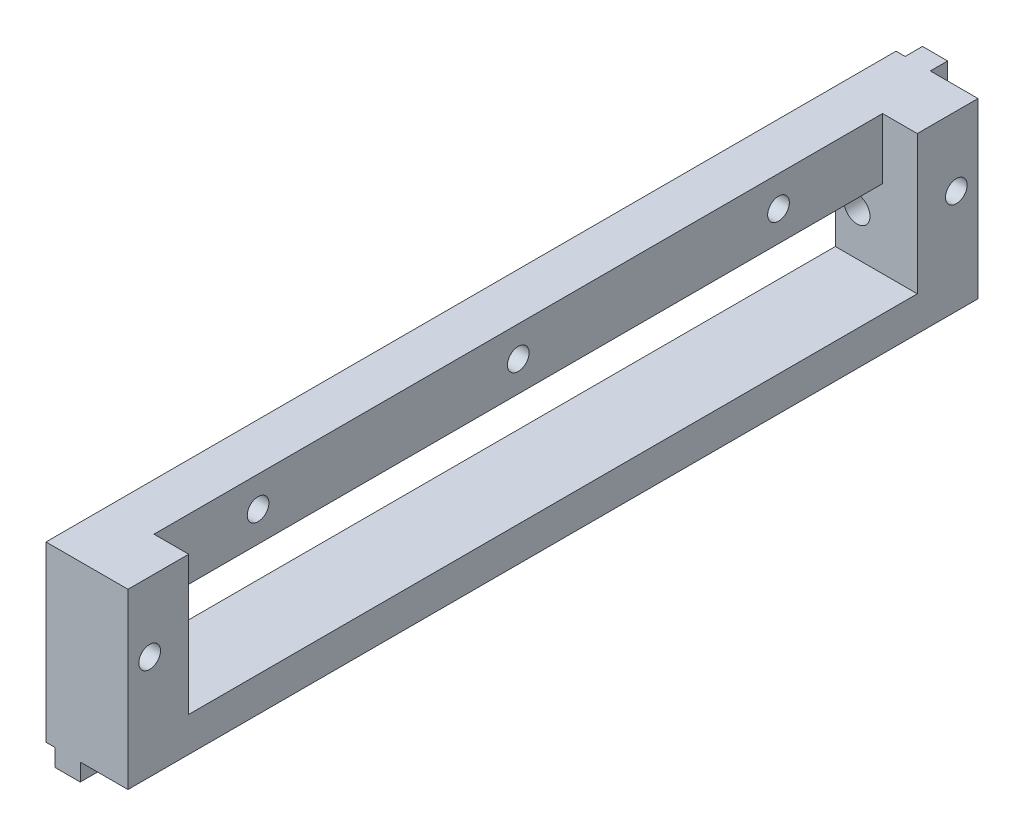
ISO-10303-21;
HEADER;
FILE_DESCRIPTION(('STEP AP214'),'2;1');
FILE_NAME('part.step','',(''),(''),'','','');
FILE_SCHEMA(('AUTOMOTIVE_DESIGN { 1 0 10303 214 1 1 1 1 }'));
ENDSEC;
DATA;
#1=APPLICATION_CONTEXT('core data for automotive mechanical design processes');
#2=APPLICATION_PROTOCOL_DEFINITION('international standard','automotive_design',2000,#1);
#3=PRODUCT_CONTEXT('',#1,'mechanical');
#4=PRODUCT('Part','Part','',(#3));
#5=PRODUCT_RELATED_PRODUCT_CATEGORY('part','',(#4));
#6=PRODUCT_DEFINITION_FORMATION('','',#4);
#7=PRODUCT_DEFINITION_CONTEXT('part definition',#1,'design');
#8=PRODUCT_DEFINITION('design','',#6,#7);
#9=PRODUCT_DEFINITION_SHAPE('','',#8);
#10=(LENGTH_UNIT() NAMED_UNIT(*) SI_UNIT(.MILLI.,.METRE.));
#11=(NAMED_UNIT(*) PLANE_ANGLE_UNIT() SI_UNIT($,.RADIAN.));
#12=(NAMED_UNIT(*) SI_UNIT($,.STERADIAN.) SOLID_ANGLE_UNIT());
#13=UNCERTAINTY_MEASURE_WITH_UNIT(LENGTH_MEASURE(1.E-05),#10,'distance_accuracy_value','');
#14=(GEOMETRIC_REPRESENTATION_CONTEXT(3) GLOBAL_UNCERTAINTY_ASSIGNED_CONTEXT((#13)) GLOBAL_UNIT_ASSIGNED_CONTEXT((#10,
#11,#12)) REPRESENTATION_CONTEXT('',''));
#15=CARTESIAN_POINT('',(0.,0.,0.));
#16=DIRECTION('',(0.,0.,1.));
#17=DIRECTION('',(1.,0.,0.));
#18=AXIS2_PLACEMENT_3D('',#15,#16,#17);
#19=CARTESIAN_POINT('',(1.05,0.,-51.));
#20=DIRECTION('',(1.,0.,0.));
#21=DIRECTION('',(0.,0.,-1.));
#22=AXIS2_PLACEMENT_3D('',#19,#20,#21);
#23=PLANE('',#22);
#24=DIRECTION('',(0.,1.,0.));
#25=VECTOR('',#24,1.);
#26=CARTESIAN_POINT('',(1.05,0.,-49.));
#27=LINE('',#26,#25);
#28=CARTESIAN_POINT('',(1.05,0.,-49.));
#29=VERTEX_POINT('',#28);
#30=CARTESIAN_POINT('',(1.05,8.61594271260657,-49.));
#31=VERTEX_POINT('',#30);
#32=EDGE_CURVE('E238',#29,#31,#27,.T.);
#33=ORIENTED_EDGE('',*,*,#32,.T.);
#34=DIRECTION('',(0.,0.,-1.));
#35=VECTOR('',#34,1.);
#36=CARTESIAN_POINT('',(1.05,8.61594271260657,-31.));
#37=LINE('',#36,#35);
#38=CARTESIAN_POINT('',(1.05,8.61594271260657,-51.));
#39=VERTEX_POINT('',#38);
#40=EDGE_CURVE('E221',#31,#39,#37,.T.);
#41=ORIENTED_EDGE('',*,*,#40,.T.);
#42=DIRECTION('',(0.,1.,0.));
#43=VECTOR('',#42,1.);
#44=CARTESIAN_POINT('',(1.05,0.,-51.));
#45=LINE('',#44,#43);
#46=CARTESIAN_POINT('',(1.05,0.,-51.));
#47=VERTEX_POINT('',#46);
#48=EDGE_CURVE('E225',#47,#39,#45,.T.);
#49=ORIENTED_EDGE('',*,*,#48,.F.);
#50=DIRECTION('',(0.,0.,1.));
#51=VECTOR('',#50,1.);
#52=CARTESIAN_POINT('',(1.05,0.,-51.));
#53=LINE('',#52,#51);
#54=EDGE_CURVE('E237',#47,#29,#53,.T.);
#55=ORIENTED_EDGE('',*,*,#54,.T.);
#56=EDGE_LOOP('',(#33,#41,#49,#55));
#57=FACE_BOUND('',#56,.T.);
#58=ADVANCED_FACE('F33',(#57),#23,.F.);
#59=CARTESIAN_POINT('',(3.95,0.,-51.));
#60=DIRECTION('',(-1.,0.,0.));
#61=DIRECTION('',(0.,0.,1.));
#62=AXIS2_PLACEMENT_3D('',#59,#60,#61);
#63=PLANE('',#62);
#64=DIRECTION('',(0.,-1.,0.));
#65=VECTOR('',#64,1.);
#66=CARTESIAN_POINT('',(3.95,0.,-49.));
#67=LINE('',#66,#65);
#68=CARTESIAN_POINT('',(3.95,20.,-49.));
#69=VERTEX_POINT('',#68);
#70=CARTESIAN_POINT('',(3.95,9.38405728739343,-49.));
#71=VERTEX_POINT('',#70);
#72=EDGE_CURVE('E242',#69,#71,#67,.T.);
#73=ORIENTED_EDGE('',*,*,#72,.T.);
#74=DIRECTION('',(0.,0.,-1.));
#75=VECTOR('',#74,1.);
#76=CARTESIAN_POINT('',(3.95,9.38405728739343,-31.));
#77=LINE('',#76,#75);
#78=CARTESIAN_POINT('',(3.95,9.38405728739343,-51.));
#79=VERTEX_POINT('',#78);
#80=EDGE_CURVE('E213',#71,#79,#77,.T.);
#81=ORIENTED_EDGE('',*,*,#80,.T.);
#82=DIRECTION('',(0.,-1.,0.));
#83=VECTOR('',#82,1.);
#84=CARTESIAN_POINT('',(3.95,0.,-51.));
#85=LINE('',#84,#83);
#86=CARTESIAN_POINT('',(3.95,20.,-51.));
#87=VERTEX_POINT('',#86);
#88=EDGE_CURVE('E232',#87,#79,#85,.T.);
#89=ORIENTED_EDGE('',*,*,#88,.F.);
#90=DIRECTION('',(0.,0.,1.));
#91=VECTOR('',#90,1.);
#92=CARTESIAN_POINT('',(3.95,20.,-51.));
#93=LINE('',#92,#91);
#94=EDGE_CURVE('E253',#87,#69,#93,.T.);
#95=ORIENTED_EDGE('',*,*,#94,.T.);
#96=EDGE_LOOP('',(#73,#81,#89,#95));
#97=FACE_BOUND('',#96,.T.);
#98=ADVANCED_FACE('F470',(#97),#63,.F.);
#99=CARTESIAN_POINT('',(0.,0.,-51.));
#100=DIRECTION('',(0.,0.,-1.));
#101=DIRECTION('',(-1.,0.,0.));
#102=AXIS2_PLACEMENT_3D('',#99,#100,#101);
#103=PLANE('',#102);
#104=CARTESIAN_POINT('',(2.5,9.,-51.));
#105=DIRECTION('',(0.,0.,-1.));
#106=DIRECTION('',(-1.,0.,0.));
#107=AXIS2_PLACEMENT_3D('',#104,#105,#106);
#108=CIRCLE('',#107,1.5);
#109=CARTESIAN_POINT('',(1.05,9.38405728739343,-51.));
#110=VERTEX_POINT('',#109);
#111=EDGE_CURVE('E208',#110,#79,#108,.T.);
#112=ORIENTED_EDGE('',*,*,#111,.F.);
#113=CARTESIAN_POINT('',(1.05,20.,-51.));
#114=VERTEX_POINT('',#113);
#115=EDGE_CURVE('E229',#110,#114,#45,.T.);
#116=ORIENTED_EDGE('',*,*,#115,.T.);
#117=DIRECTION('',(1.,0.,0.));
#118=VECTOR('',#117,1.);
#119=CARTESIAN_POINT('',(1.05,20.,-51.));
#120=LINE('',#119,#118);
#121=EDGE_CURVE('E228',#114,#87,#120,.T.);
#122=ORIENTED_EDGE('',*,*,#121,.T.);
#123=ORIENTED_EDGE('',*,*,#88,.T.);
#124=EDGE_LOOP('',(#112,#116,#122,#123));
#125=FACE_BOUND('',#124,.T.);
#126=ADVANCED_FACE('F473',(#125),#103,.T.);
#127=CARTESIAN_POINT('',(0.,0.,-49.));
#128=DIRECTION('',(0.,0.,-1.));
#129=DIRECTION('',(-1.,0.,0.));
#130=AXIS2_PLACEMENT_3D('',#127,#128,#129);
#131=PLANE('',#130);
#132=CARTESIAN_POINT('',(2.5,9.,-49.));
#133=DIRECTION('',(0.,0.,-1.));
#134=DIRECTION('',(-1.,0.,0.));
#135=AXIS2_PLACEMENT_3D('',#132,#133,#134);
#136=CIRCLE('',#135,1.5);
#137=CARTESIAN_POINT('',(1.05,9.38405728739343,-49.));
#138=VERTEX_POINT('',#137);
#139=EDGE_CURVE('E219',#31,#138,#136,.T.);
#140=ORIENTED_EDGE('',*,*,#139,.F.);
#141=ORIENTED_EDGE('',*,*,#32,.F.);
#142=DIRECTION('',(1.,0.,0.));
#143=VECTOR('',#142,1.);
#144=CARTESIAN_POINT('',(1.05,0.,-49.));
#145=LINE('',#144,#143);
#146=CARTESIAN_POINT('',(0.,0.,-49.));
#147=VERTEX_POINT('',#146);
#148=EDGE_CURVE('E323',#147,#29,#145,.T.);
#149=ORIENTED_EDGE('',*,*,#148,.F.);
#150=DIRECTION('',(0.,-1.,0.));
#151=VECTOR('',#150,1.);
#152=CARTESIAN_POINT('',(0.,0.,-49.));
#153=LINE('',#152,#151);
#154=CARTESIAN_POINT('',(0.,20.,-49.));
#155=VERTEX_POINT('',#154);
#156=EDGE_CURVE('E299',#155,#147,#153,.T.);
#157=ORIENTED_EDGE('',*,*,#156,.F.);
#158=DIRECTION('',(-1.,0.,0.));
#159=VECTOR('',#158,1.);
#160=CARTESIAN_POINT('',(0.,20.,-49.));
#161=LINE('',#160,#159);
#162=CARTESIAN_POINT('',(1.05,20.,-49.));
#163=VERTEX_POINT('',#162);
#164=EDGE_CURVE('E338',#163,#155,#161,.T.);
#165=ORIENTED_EDGE('',*,*,#164,.F.);
#166=EDGE_CURVE('E224',#138,#163,#27,.T.);
#167=ORIENTED_EDGE('',*,*,#166,.F.);
#168=EDGE_LOOP('',(#140,#141,#149,#157,#165,#167));
#169=FACE_BOUND('',#168,.T.);
#170=ADVANCED_FACE('F405',(#169),#131,.T.);
#171=DIRECTION('',(-1.,0.,0.));
#172=VECTOR('',#171,1.);
#173=CARTESIAN_POINT('',(1.05,0.,-49.));
#174=LINE('',#173,#172);
#175=CARTESIAN_POINT('',(3.95,0.,-49.));
#176=VERTEX_POINT('',#175);
#177=EDGE_CURVE('E245',#176,#29,#174,.T.);
#178=ORIENTED_EDGE('',*,*,#177,.F.);
#179=DIRECTION('',(0.,1.,0.));
#180=VECTOR('',#179,1.);
#181=CARTESIAN_POINT('',(3.95,0.,-49.));
#182=LINE('',#181,#180);
#183=CARTESIAN_POINT('',(3.95,-2.,-49.));
#184=VERTEX_POINT('',#183);
#185=EDGE_CURVE('E330',#184,#176,#182,.T.);
#186=ORIENTED_EDGE('',*,*,#185,.F.);
#187=DIRECTION('',(1.,0.,0.));
#188=VECTOR('',#187,1.);
#189=CARTESIAN_POINT('',(3.95,-2.,-49.));
#190=LINE('',#189,#188);
#191=CARTESIAN_POINT('',(1.05,-2.,-49.));
#192=VERTEX_POINT('',#191);
#193=EDGE_CURVE('E328',#192,#184,#190,.T.);
#194=ORIENTED_EDGE('',*,*,#193,.F.);
#195=DIRECTION('',(0.,-1.,0.));
#196=VECTOR('',#195,1.);
#197=CARTESIAN_POINT('',(1.05,-2.,-49.));
#198=LINE('',#197,#196);
#199=EDGE_CURVE('E326',#29,#192,#198,.T.);
#200=ORIENTED_EDGE('',*,*,#199,.F.);
#201=EDGE_LOOP('',(#178,#186,#194,#200));
#202=FACE_BOUND('',#201,.T.);
#203=ADVANCED_FACE('F393',(#202),#131,.T.);
#204=CARTESIAN_POINT('',(0.,0.,49.));
#205=DIRECTION('',(1.,0.,0.));
#206=DIRECTION('',(0.,0.,-1.));
#207=AXIS2_PLACEMENT_3D('',#204,#205,#206);
#208=PLANE('',#207);
#209=DIRECTION('',(0.,0.,1.));
#210=VECTOR('',#209,1.);
#211=CARTESIAN_POINT('',(0.,13.,42.));
#212=LINE('',#211,#210);
#213=CARTESIAN_POINT('',(0.,13.,-42.));
#214=VERTEX_POINT('',#213);
#215=CARTESIAN_POINT('',(0.,13.,42.));
#216=VERTEX_POINT('',#215);
#217=EDGE_CURVE('E196',#214,#216,#212,.T.);
#218=ORIENTED_EDGE('',*,*,#217,.T.);
#219=DIRECTION('',(0.,-1.,0.));
#220=VECTOR('',#219,1.);
#221=CARTESIAN_POINT('',(0.,3.99999999999999,42.));
#222=LINE('',#221,#220);
#223=CARTESIAN_POINT('',(0.,3.99999999999999,42.));
#224=VERTEX_POINT('',#223);
#225=EDGE_CURVE('E180',#216,#224,#222,.T.);
#226=ORIENTED_EDGE('',*,*,#225,.T.);
#227=DIRECTION('',(0.,0.,-1.));
#228=VECTOR('',#227,1.);
#229=CARTESIAN_POINT('',(0.,3.99999999999999,42.));
#230=LINE('',#229,#228);
#231=CARTESIAN_POINT('',(0.,3.99999999999999,-42.));
#232=VERTEX_POINT('',#231);
#233=EDGE_CURVE('E188',#224,#232,#230,.T.);
#234=ORIENTED_EDGE('',*,*,#233,.T.);
#235=DIRECTION('',(0.,1.,0.));
#236=VECTOR('',#235,1.);
#237=CARTESIAN_POINT('',(0.,3.99999999999999,-42.));
#238=LINE('',#237,#236);
#239=EDGE_CURVE('E192',#232,#214,#238,.T.);
#240=ORIENTED_EDGE('',*,*,#239,.T.);
#241=EDGE_LOOP('',(#218,#226,#234,#240));
#242=FACE_BOUND('',#241,.T.);
#243=CARTESIAN_POINT('',(0.,16.5,-30.));
#244=DIRECTION('',(-1.,0.,0.));
#245=DIRECTION('',(0.,0.,1.));
#246=AXIS2_PLACEMENT_3D('',#243,#244,#245);
#247=CIRCLE('',#246,1.25);
#248=CARTESIAN_POINT('',(0.,16.5,-28.75));
#249=VERTEX_POINT('',#248);
#250=EDGE_CURVE('E260',#249,#249,#247,.T.);
#251=ORIENTED_EDGE('',*,*,#250,.F.);
#252=EDGE_LOOP('',(#251));
#253=FACE_BOUND('',#252,.T.);
#254=CARTESIAN_POINT('',(0.,16.5,30.));
#255=DIRECTION('',(-1.,0.,0.));
#256=DIRECTION('',(0.,0.,1.));
#257=AXIS2_PLACEMENT_3D('',#254,#255,#256);
#258=CIRCLE('',#257,1.25);
#259=CARTESIAN_POINT('',(0.,16.5,31.25));
#260=VERTEX_POINT('',#259);
#261=EDGE_CURVE('E259',#260,#260,#258,.T.);
#262=ORIENTED_EDGE('',*,*,#261,.F.);
#263=EDGE_LOOP('',(#262));
#264=FACE_BOUND('',#263,.T.);
#265=CARTESIAN_POINT('',(0.,16.5,0.));
#266=DIRECTION('',(-1.,0.,0.));
#267=DIRECTION('',(0.,0.,1.));
#268=AXIS2_PLACEMENT_3D('',#265,#266,#267);
#269=CIRCLE('',#268,1.25);
#270=CARTESIAN_POINT('',(0.,16.5,1.25));
#271=VERTEX_POINT('',#270);
#272=EDGE_CURVE('E266',#271,#271,#269,.T.);
#273=ORIENTED_EDGE('',*,*,#272,.F.);
#274=EDGE_LOOP('',(#273));
#275=FACE_BOUND('',#274,.T.);
#276=CARTESIAN_POINT('',(0.,12.,46.5));
#277=DIRECTION('',(1.,0.,0.));
#278=DIRECTION('',(0.,0.,-1.));
#279=AXIS2_PLACEMENT_3D('',#276,#277,#278);
#280=CIRCLE('',#279,1.25);
#281=CARTESIAN_POINT('',(0.,12.,45.25));
#282=VERTEX_POINT('',#281);
#283=EDGE_CURVE('E290',#282,#282,#280,.T.);
#284=ORIENTED_EDGE('',*,*,#283,.T.);
#285=EDGE_LOOP('',(#284));
#286=FACE_BOUND('',#285,.T.);
#287=CARTESIAN_POINT('',(0.,12.,-46.5));
#288=DIRECTION('',(1.,0.,0.));
#289=DIRECTION('',(0.,0.,-1.));
#290=AXIS2_PLACEMENT_3D('',#287,#288,#289);
#291=CIRCLE('',#290,1.25);
#292=CARTESIAN_POINT('',(0.,12.,-47.75));
#293=VERTEX_POINT('',#292);
#294=EDGE_CURVE('E296',#293,#293,#291,.T.);
#295=ORIENTED_EDGE('',*,*,#294,.T.);
#296=EDGE_LOOP('',(#295));
#297=FACE_BOUND('',#296,.T.);
#298=ORIENTED_EDGE('',*,*,#156,.T.);
#299=DIRECTION('',(0.,0.,-1.));
#300=VECTOR('',#299,1.);
#301=CARTESIAN_POINT('',(0.,0.,49.));
#302=LINE('',#301,#300);
#303=CARTESIAN_POINT('',(0.,0.,49.));
#304=VERTEX_POINT('',#303);
#305=EDGE_CURVE('E42',#304,#147,#302,.T.);
#306=ORIENTED_EDGE('',*,*,#305,.F.);
#307=DIRECTION('',(0.,-1.,0.));
#308=VECTOR('',#307,1.);
#309=CARTESIAN_POINT('',(0.,0.,49.));
#310=LINE('',#309,#308);
#311=CARTESIAN_POINT('',(0.,20.,49.));
#312=VERTEX_POINT('',#311);
#313=EDGE_CURVE('E302',#312,#304,#310,.T.);
#314=ORIENTED_EDGE('',*,*,#313,.F.);
#315=DIRECTION('',(0.,0.,-1.));
#316=VECTOR('',#315,1.);
#317=CARTESIAN_POINT('',(0.,20.,49.));
#318=LINE('',#317,#316);
#319=EDGE_CURVE('E320',#312,#155,#318,.T.);
#320=ORIENTED_EDGE('',*,*,#319,.T.);
#321=EDGE_LOOP('',(#298,#306,#314,#320));
#322=FACE_BOUND('',#321,.T.);
#323=ADVANCED_FACE('F35',(#242,#253,#264,#275,#286,#297,#322),#208,.F.);
#324=CARTESIAN_POINT('',(1.05,0.,49.));
#325=DIRECTION('',(0.,1.,0.));
#326=DIRECTION('',(-1.,0.,0.));
#327=AXIS2_PLACEMENT_3D('',#324,#325,#326);
#328=PLANE('',#327);
#329=ORIENTED_EDGE('',*,*,#148,.T.);
#330=DIRECTION('',(0.,0.,-1.));
#331=VECTOR('',#330,1.);
#332=CARTESIAN_POINT('',(1.05,0.,49.));
#333=LINE('',#332,#331);
#334=CARTESIAN_POINT('',(1.05,0.,49.));
#335=VERTEX_POINT('',#334);
#336=EDGE_CURVE('E359',#335,#29,#333,.T.);
#337=ORIENTED_EDGE('',*,*,#336,.F.);
#338=DIRECTION('',(1.,0.,0.));
#339=VECTOR('',#338,1.);
#340=CARTESIAN_POINT('',(1.05,0.,49.));
#341=LINE('',#340,#339);
#342=EDGE_CURVE('E305',#304,#335,#341,.T.);
#343=ORIENTED_EDGE('',*,*,#342,.F.);
#344=ORIENTED_EDGE('',*,*,#305,.T.);
#345=EDGE_LOOP('',(#329,#337,#343,#344));
#346=FACE_BOUND('',#345,.T.);
#347=ADVANCED_FACE('F392',(#346),#328,.F.);
#348=CARTESIAN_POINT('',(1.05,-2.,49.));
#349=DIRECTION('',(1.,0.,0.));
#350=DIRECTION('',(0.,0.,-1.));
#351=AXIS2_PLACEMENT_3D('',#348,#349,#350);
#352=PLANE('',#351);
#353=ORIENTED_EDGE('',*,*,#199,.T.);
#354=DIRECTION('',(0.,0.,-1.));
#355=VECTOR('',#354,1.);
#356=CARTESIAN_POINT('',(1.05,-2.,49.));
#357=LINE('',#356,#355);
#358=CARTESIAN_POINT('',(1.05,-2.,49.));
#359=VERTEX_POINT('',#358);
#360=EDGE_CURVE('E356',#359,#192,#357,.T.);
#361=ORIENTED_EDGE('',*,*,#360,.F.);
#362=DIRECTION('',(0.,-1.,0.));
#363=VECTOR('',#362,1.);
#364=CARTESIAN_POINT('',(1.05,-2.,49.));
#365=LINE('',#364,#363);
#366=EDGE_CURVE('E308',#335,#359,#365,.T.);
#367=ORIENTED_EDGE('',*,*,#366,.F.);
#368=ORIENTED_EDGE('',*,*,#336,.T.);
#369=EDGE_LOOP('',(#353,#361,#367,#368));
#370=FACE_BOUND('',#369,.T.);
#371=ADVANCED_FACE('F438',(#370),#352,.F.);
#372=CARTESIAN_POINT('',(3.95,-2.,49.));
#373=DIRECTION('',(0.,1.,0.));
#374=DIRECTION('',(-1.,0.,0.));
#375=AXIS2_PLACEMENT_3D('',#372,#373,#374);
#376=PLANE('',#375);
#377=ORIENTED_EDGE('',*,*,#193,.T.);
#378=DIRECTION('',(0.,0.,-1.));
#379=VECTOR('',#378,1.);
#380=CARTESIAN_POINT('',(3.95,-2.,49.));
#381=LINE('',#380,#379);
#382=CARTESIAN_POINT('',(3.95,-2.,49.));
#383=VERTEX_POINT('',#382);
#384=EDGE_CURVE('E353',#383,#184,#381,.T.);
#385=ORIENTED_EDGE('',*,*,#384,.F.);
#386=DIRECTION('',(1.,0.,0.));
#387=VECTOR('',#386,1.);
#388=CARTESIAN_POINT('',(3.95,-2.,49.));
#389=LINE('',#388,#387);
#390=EDGE_CURVE('E310',#359,#383,#389,.T.);
#391=ORIENTED_EDGE('',*,*,#390,.F.);
#392=ORIENTED_EDGE('',*,*,#360,.T.);
#393=EDGE_LOOP('',(#377,#385,#391,#392));
#394=FACE_BOUND('',#393,.T.);
#395=ADVANCED_FACE('F441',(#394),#376,.F.);
#396=CARTESIAN_POINT('',(3.95,0.,49.));
#397=DIRECTION('',(-1.,0.,0.));
#398=DIRECTION('',(0.,0.,1.));
#399=AXIS2_PLACEMENT_3D('',#396,#397,#398);
#400=PLANE('',#399);
#401=ORIENTED_EDGE('',*,*,#185,.T.);
#402=DIRECTION('',(0.,0.,-1.));
#403=VECTOR('',#402,1.);
#404=CARTESIAN_POINT('',(3.95,0.,49.));
#405=LINE('',#404,#403);
#406=CARTESIAN_POINT('',(3.95,0.,49.));
#407=VERTEX_POINT('',#406);
#408=EDGE_CURVE('E350',#407,#176,#405,.T.);
#409=ORIENTED_EDGE('',*,*,#408,.F.);
#410=DIRECTION('',(0.,1.,0.));
#411=VECTOR('',#410,1.);
#412=CARTESIAN_POINT('',(3.95,0.,49.));
#413=LINE('',#412,#411);
#414=EDGE_CURVE('E312',#383,#407,#413,.T.);
#415=ORIENTED_EDGE('',*,*,#414,.F.);
#416=ORIENTED_EDGE('',*,*,#384,.T.);
#417=EDGE_LOOP('',(#401,#409,#415,#416));
#418=FACE_BOUND('',#417,.T.);
#419=ADVANCED_FACE('F448',(#418),#400,.F.);
#420=CARTESIAN_POINT('',(9.45,0.,49.));
#421=DIRECTION('',(0.,1.,0.));
#422=DIRECTION('',(-1.,0.,0.));
#423=AXIS2_PLACEMENT_3D('',#420,#421,#422);
#424=PLANE('',#423);
#425=DIRECTION('',(1.,0.,0.));
#426=VECTOR('',#425,1.);
#427=CARTESIAN_POINT('',(9.45,0.,-49.));
#428=LINE('',#427,#426);
#429=CARTESIAN_POINT('',(9.45,0.,-49.));
#430=VERTEX_POINT('',#429);
#431=EDGE_CURVE('E333',#176,#430,#428,.T.);
#432=ORIENTED_EDGE('',*,*,#431,.T.);
#433=DIRECTION('',(0.,0.,-1.));
#434=VECTOR('',#433,1.);
#435=CARTESIAN_POINT('',(9.45,0.,49.));
#436=LINE('',#435,#434);
#437=CARTESIAN_POINT('',(9.45,0.,49.));
#438=VERTEX_POINT('',#437);
#439=EDGE_CURVE('E347',#438,#430,#436,.T.);
#440=ORIENTED_EDGE('',*,*,#439,.F.);
#441=DIRECTION('',(1.,0.,0.));
#442=VECTOR('',#441,1.);
#443=CARTESIAN_POINT('',(9.45,0.,49.));
#444=LINE('',#443,#442);
#445=EDGE_CURVE('E314',#407,#438,#444,.T.);
#446=ORIENTED_EDGE('',*,*,#445,.F.);
#447=ORIENTED_EDGE('',*,*,#408,.T.);
#448=EDGE_LOOP('',(#432,#440,#446,#447));
#449=FACE_BOUND('',#448,.T.);
#450=ADVANCED_FACE('F450',(#449),#424,.F.);
#451=CARTESIAN_POINT('',(9.45,20.,49.));
#452=DIRECTION('',(-1.,0.,0.));
#453=DIRECTION('',(0.,-1.,0.));
#454=AXIS2_PLACEMENT_3D('',#451,#452,#453);
#455=PLANE('',#454);
#456=CARTESIAN_POINT('',(9.45,12.,46.5));
#457=DIRECTION('',(1.,0.,0.));
#458=DIRECTION('',(0.,0.,-1.));
#459=AXIS2_PLACEMENT_3D('',#456,#457,#458);
#460=CIRCLE('',#459,1.25);
#461=CARTESIAN_POINT('',(9.45,12.,45.25));
#462=VERTEX_POINT('',#461);
#463=EDGE_CURVE('E285',#462,#462,#460,.T.);
#464=ORIENTED_EDGE('',*,*,#463,.F.);
#465=EDGE_LOOP('',(#464));
#466=FACE_BOUND('',#465,.T.);
#467=CARTESIAN_POINT('',(9.45,12.,-46.5));
#468=DIRECTION('',(1.,0.,0.));
#469=DIRECTION('',(0.,0.,-1.));
#470=AXIS2_PLACEMENT_3D('',#467,#468,#469);
#471=CIRCLE('',#470,1.25);
#472=CARTESIAN_POINT('',(9.45,12.,-47.75));
#473=VERTEX_POINT('',#472);
#474=EDGE_CURVE('E293',#473,#473,#471,.T.);
#475=ORIENTED_EDGE('',*,*,#474,.F.);
#476=EDGE_LOOP('',(#475));
#477=FACE_BOUND('',#476,.T.);
#478=DIRECTION('',(0.,0.,-1.));
#479=VECTOR('',#478,1.);
#480=CARTESIAN_POINT('',(9.45,20.,49.));
#481=LINE('',#480,#479);
#482=CARTESIAN_POINT('',(9.45,20.,-42.));
#483=VERTEX_POINT('',#482);
#484=CARTESIAN_POINT('',(9.45,20.,-49.));
#485=VERTEX_POINT('',#484);
#486=EDGE_CURVE('E343',#483,#485,#481,.T.);
#487=ORIENTED_EDGE('',*,*,#486,.F.);
#488=DIRECTION('',(0.,1.,0.));
#489=VECTOR('',#488,1.);
#490=CARTESIAN_POINT('',(9.45,4.,-42.));
#491=LINE('',#490,#489);
#492=CARTESIAN_POINT('',(9.45,4.,-42.));
#493=VERTEX_POINT('',#492);
#494=EDGE_CURVE('E281',#493,#483,#491,.T.);
#495=ORIENTED_EDGE('',*,*,#494,.F.);
#496=DIRECTION('',(0.,0.,-1.));
#497=VECTOR('',#496,1.);
#498=CARTESIAN_POINT('',(9.45,4.,-42.));
#499=LINE('',#498,#497);
#500=CARTESIAN_POINT('',(9.45,3.99999999999999,42.));
#501=VERTEX_POINT('',#500);
#502=EDGE_CURVE('E274',#501,#493,#499,.T.);
#503=ORIENTED_EDGE('',*,*,#502,.F.);
#504=DIRECTION('',(0.,-1.,0.));
#505=VECTOR('',#504,1.);
#506=CARTESIAN_POINT('',(9.45,3.99999999999999,42.));
#507=LINE('',#506,#505);
#508=CARTESIAN_POINT('',(9.45,20.,42.));
#509=VERTEX_POINT('',#508);
#510=EDGE_CURVE('E183',#509,#501,#507,.T.);
#511=ORIENTED_EDGE('',*,*,#510,.F.);
#512=CARTESIAN_POINT('',(9.45,20.,49.));
#513=VERTEX_POINT('',#512);
#514=EDGE_CURVE('E344',#513,#509,#481,.T.);
#515=ORIENTED_EDGE('',*,*,#514,.F.);
#516=DIRECTION('',(0.,1.,0.));
#517=VECTOR('',#516,1.);
#518=CARTESIAN_POINT('',(9.45,20.,49.));
#519=LINE('',#518,#517);
#520=EDGE_CURVE('E316',#438,#513,#519,.T.);
#521=ORIENTED_EDGE('',*,*,#520,.F.);
#522=ORIENTED_EDGE('',*,*,#439,.T.);
#523=DIRECTION('',(0.,1.,0.));
#524=VECTOR('',#523,1.);
#525=CARTESIAN_POINT('',(9.45,20.,-49.));
#526=LINE('',#525,#524);
#527=EDGE_CURVE('E335',#430,#485,#526,.T.);
#528=ORIENTED_EDGE('',*,*,#527,.T.);
#529=EDGE_LOOP('',(#487,#495,#503,#511,#515,#521,#522,#528));
#530=FACE_BOUND('',#529,.T.);
#531=ADVANCED_FACE('F455',(#466,#477,#530),#455,.F.);
#532=CARTESIAN_POINT('',(0.,20.,49.));
#533=DIRECTION('',(0.,-1.,0.));
#534=DIRECTION('',(0.,0.,-1.));
#535=AXIS2_PLACEMENT_3D('',#532,#533,#534);
#536=PLANE('',#535);
#537=DIRECTION('',(0.,0.,1.));
#538=VECTOR('',#537,1.);
#539=CARTESIAN_POINT('',(5.45,20.,-42.));
#540=LINE('',#539,#538);
#541=CARTESIAN_POINT('',(5.45,20.,-42.));
#542=VERTEX_POINT('',#541);
#543=CARTESIAN_POINT('',(5.45,20.,42.));
#544=VERTEX_POINT('',#543);
#545=EDGE_CURVE('E273',#542,#544,#540,.T.);
#546=ORIENTED_EDGE('',*,*,#545,.F.);
#547=DIRECTION('',(1.,0.,0.));
#548=VECTOR('',#547,1.);
#549=CARTESIAN_POINT('',(5.45,20.,-42.));
#550=LINE('',#549,#548);
#551=EDGE_CURVE('E280',#542,#483,#550,.T.);
#552=ORIENTED_EDGE('',*,*,#551,.T.);
#553=ORIENTED_EDGE('',*,*,#486,.T.);
#554=EDGE_CURVE('E306',#485,#69,#161,.T.);
#555=ORIENTED_EDGE('',*,*,#554,.T.);
#556=ORIENTED_EDGE('',*,*,#94,.F.);
#557=ORIENTED_EDGE('',*,*,#121,.F.);
#558=DIRECTION('',(0.,0.,1.));
#559=VECTOR('',#558,1.);
#560=CARTESIAN_POINT('',(1.05,20.,-51.));
#561=LINE('',#560,#559);
#562=EDGE_CURVE('E256',#114,#163,#561,.T.);
#563=ORIENTED_EDGE('',*,*,#562,.T.);
#564=ORIENTED_EDGE('',*,*,#164,.T.);
#565=ORIENTED_EDGE('',*,*,#319,.F.);
#566=DIRECTION('',(-1.,0.,0.));
#567=VECTOR('',#566,1.);
#568=CARTESIAN_POINT('',(0.,20.,49.));
#569=LINE('',#568,#567);
#570=EDGE_CURVE('E318',#513,#312,#569,.T.);
#571=ORIENTED_EDGE('',*,*,#570,.F.);
#572=ORIENTED_EDGE('',*,*,#514,.T.);
#573=DIRECTION('',(1.,0.,0.));
#574=VECTOR('',#573,1.);
#575=CARTESIAN_POINT('',(5.45,20.,42.));
#576=LINE('',#575,#574);
#577=EDGE_CURVE('E185',#544,#509,#576,.T.);
#578=ORIENTED_EDGE('',*,*,#577,.F.);
#579=EDGE_LOOP('',(#546,#552,#553,#555,#556,#557,#563,#564,#565,#571,#572,#578));
#580=FACE_BOUND('',#579,.T.);
#581=ADVANCED_FACE('F417',(#580),#536,.F.);
#582=CARTESIAN_POINT('',(0.,0.,49.));
#583=DIRECTION('',(0.,0.,-1.));
#584=DIRECTION('',(-1.,0.,0.));
#585=AXIS2_PLACEMENT_3D('',#582,#583,#584);
#586=PLANE('',#585);
#587=ORIENTED_EDGE('',*,*,#313,.T.);
#588=ORIENTED_EDGE('',*,*,#342,.T.);
#589=ORIENTED_EDGE('',*,*,#366,.T.);
#590=ORIENTED_EDGE('',*,*,#390,.T.);
#591=ORIENTED_EDGE('',*,*,#414,.T.);
#592=ORIENTED_EDGE('',*,*,#445,.T.);
#593=ORIENTED_EDGE('',*,*,#520,.T.);
#594=ORIENTED_EDGE('',*,*,#570,.T.);
#595=EDGE_LOOP('',(#587,#588,#589,#590,#591,#592,#593,#594));
#596=FACE_BOUND('',#595,.T.);
#597=ADVANCED_FACE('F411',(#596),#586,.F.);
#598=CARTESIAN_POINT('',(2.5,9.,-49.));
#599=DIRECTION('',(0.,0.,-1.));
#600=DIRECTION('',(-1.,0.,0.));
#601=AXIS2_PLACEMENT_3D('',#598,#599,#600);
#602=CIRCLE('',#601,1.5);
#603=CARTESIAN_POINT('',(3.95,8.61594271260657,-49.));
#604=VERTEX_POINT('',#603);
#605=EDGE_CURVE('E211',#71,#604,#602,.T.);
#606=ORIENTED_EDGE('',*,*,#605,.F.);
#607=ORIENTED_EDGE('',*,*,#72,.F.);
#608=ORIENTED_EDGE('',*,*,#554,.F.);
#609=ORIENTED_EDGE('',*,*,#527,.F.);
#610=ORIENTED_EDGE('',*,*,#431,.F.);
#611=EDGE_CURVE('E241',#604,#176,#67,.T.);
#612=ORIENTED_EDGE('',*,*,#611,.F.);
#613=EDGE_LOOP('',(#606,#607,#608,#609,#610,#612));
#614=FACE_BOUND('',#613,.T.);
#615=ADVANCED_FACE('F467',(#614),#131,.T.);
#616=CARTESIAN_POINT('',(0.,12.,-46.5));
#617=DIRECTION('',(1.,0.,0.));
#618=DIRECTION('',(0.,0.,-1.));
#619=AXIS2_PLACEMENT_3D('',#616,#617,#618);
#620=CYLINDRICAL_SURFACE('',#619,1.25);
#621=ORIENTED_EDGE('',*,*,#294,.F.);
#622=EDGE_LOOP('',(#621));
#623=FACE_BOUND('',#622,.T.);
#624=ORIENTED_EDGE('',*,*,#474,.T.);
#625=EDGE_LOOP('',(#624));
#626=FACE_BOUND('',#625,.T.);
#627=ADVANCED_FACE('F519',(#623,#626),#620,.F.);
#628=CARTESIAN_POINT('',(0.,12.,46.5));
#629=DIRECTION('',(1.,0.,0.));
#630=DIRECTION('',(0.,0.,-1.));
#631=AXIS2_PLACEMENT_3D('',#628,#629,#630);
#632=CYLINDRICAL_SURFACE('',#631,1.25);
#633=ORIENTED_EDGE('',*,*,#283,.F.);
#634=EDGE_LOOP('',(#633));
#635=FACE_BOUND('',#634,.T.);
#636=ORIENTED_EDGE('',*,*,#463,.T.);
#637=EDGE_LOOP('',(#636));
#638=FACE_BOUND('',#637,.T.);
#639=ADVANCED_FACE('F516',(#635,#638),#632,.F.);
#640=CARTESIAN_POINT('',(5.45,4.,-42.));
#641=DIRECTION('',(0.,0.,-1.));
#642=DIRECTION('',(0.,1.,0.));
#643=AXIS2_PLACEMENT_3D('',#640,#641,#642);
#644=PLANE('',#643);
#645=ORIENTED_EDGE('',*,*,#494,.T.);
#646=ORIENTED_EDGE('',*,*,#551,.F.);
#647=DIRECTION('',(0.,1.,0.));
#648=VECTOR('',#647,1.);
#649=CARTESIAN_POINT('',(5.45,4.,-42.));
#650=LINE('',#649,#648);
#651=CARTESIAN_POINT('',(5.45,13.,-42.));
#652=VERTEX_POINT('',#651);
#653=EDGE_CURVE('E271',#652,#542,#650,.T.);
#654=ORIENTED_EDGE('',*,*,#653,.F.);
#655=DIRECTION('',(1.,0.,0.));
#656=VECTOR('',#655,1.);
#657=CARTESIAN_POINT('',(0.,13.,-42.));
#658=LINE('',#657,#656);
#659=EDGE_CURVE('E203',#214,#652,#658,.T.);
#660=ORIENTED_EDGE('',*,*,#659,.F.);
#661=ORIENTED_EDGE('',*,*,#239,.F.);
#662=DIRECTION('',(1.,0.,0.));
#663=VECTOR('',#662,1.);
#664=CARTESIAN_POINT('',(5.45,4.,-42.));
#665=LINE('',#664,#663);
#666=EDGE_CURVE('E49',#232,#493,#665,.T.);
#667=ORIENTED_EDGE('',*,*,#666,.T.);
#668=EDGE_LOOP('',(#645,#646,#654,#660,#661,#667));
#669=FACE_BOUND('',#668,.T.);
#670=CARTESIAN_POINT('',(2.5,9.,-42.));
#671=DIRECTION('',(0.,0.,-1.));
#672=DIRECTION('',(-1.,0.,0.));
#673=AXIS2_PLACEMENT_3D('',#670,#671,#672);
#674=CIRCLE('',#673,1.5);
#675=CARTESIAN_POINT('',(1.,9.,-42.));
#676=VERTEX_POINT('',#675);
#677=EDGE_CURVE('E37',#676,#676,#674,.F.);
#678=ORIENTED_EDGE('',*,*,#677,.F.);
#679=EDGE_LOOP('',(#678));
#680=FACE_BOUND('',#679,.T.);
#681=ADVANCED_FACE('F461',(#669,#680),#644,.F.);
#682=CARTESIAN_POINT('',(5.45,4.,-42.));
#683=DIRECTION('',(0.,-1.,0.));
#684=DIRECTION('',(0.,0.,-1.));
#685=AXIS2_PLACEMENT_3D('',#682,#683,#684);
#686=PLANE('',#685);
#687=ORIENTED_EDGE('',*,*,#502,.T.);
#688=ORIENTED_EDGE('',*,*,#666,.F.);
#689=ORIENTED_EDGE('',*,*,#233,.F.);
#690=DIRECTION('',(1.,0.,0.));
#691=VECTOR('',#690,1.);
#692=CARTESIAN_POINT('',(5.45,3.99999999999999,42.));
#693=LINE('',#692,#691);
#694=EDGE_CURVE('E177',#224,#501,#693,.T.);
#695=ORIENTED_EDGE('',*,*,#694,.T.);
#696=EDGE_LOOP('',(#687,#688,#689,#695));
#697=FACE_BOUND('',#696,.T.);
#698=ADVANCED_FACE('F189',(#697),#686,.F.);
#699=CARTESIAN_POINT('',(5.45,3.99999999999999,42.));
#700=DIRECTION('',(0.,0.,1.));
#701=DIRECTION('',(0.,-1.,0.));
#702=AXIS2_PLACEMENT_3D('',#699,#700,#701);
#703=PLANE('',#702);
#704=ORIENTED_EDGE('',*,*,#510,.T.);
#705=ORIENTED_EDGE('',*,*,#694,.F.);
#706=ORIENTED_EDGE('',*,*,#225,.F.);
#707=DIRECTION('',(1.,0.,0.));
#708=VECTOR('',#707,1.);
#709=CARTESIAN_POINT('',(0.,13.,42.));
#710=LINE('',#709,#708);
#711=CARTESIAN_POINT('',(5.45,13.,42.));
#712=VERTEX_POINT('',#711);
#713=EDGE_CURVE('E205',#216,#712,#710,.T.);
#714=ORIENTED_EDGE('',*,*,#713,.T.);
#715=DIRECTION('',(0.,-1.,0.));
#716=VECTOR('',#715,1.);
#717=CARTESIAN_POINT('',(5.45,3.99999999999999,42.));
#718=LINE('',#717,#716);
#719=EDGE_CURVE('E277',#544,#712,#718,.T.);
#720=ORIENTED_EDGE('',*,*,#719,.F.);
#721=ORIENTED_EDGE('',*,*,#577,.T.);
#722=EDGE_LOOP('',(#704,#705,#706,#714,#720,#721));
#723=FACE_BOUND('',#722,.T.);
#724=ADVANCED_FACE('F178',(#723),#703,.F.);
#725=CARTESIAN_POINT('',(5.45,0.,0.));
#726=DIRECTION('',(1.,0.,0.));
#727=DIRECTION('',(0.,1.,0.));
#728=AXIS2_PLACEMENT_3D('',#725,#726,#727);
#729=PLANE('',#728);
#730=DIRECTION('',(0.,0.,1.));
#731=VECTOR('',#730,1.);
#732=CARTESIAN_POINT('',(5.45,13.,42.));
#733=LINE('',#732,#731);
#734=EDGE_CURVE('E197',#652,#712,#733,.T.);
#735=ORIENTED_EDGE('',*,*,#734,.F.);
#736=ORIENTED_EDGE('',*,*,#653,.T.);
#737=ORIENTED_EDGE('',*,*,#545,.T.);
#738=ORIENTED_EDGE('',*,*,#719,.T.);
#739=EDGE_LOOP('',(#735,#736,#737,#738));
#740=FACE_BOUND('',#739,.T.);
#741=CARTESIAN_POINT('',(5.45,16.5,-30.));
#742=DIRECTION('',(1.,0.,0.));
#743=DIRECTION('',(0.,1.,0.));
#744=AXIS2_PLACEMENT_3D('',#741,#742,#743);
#745=CIRCLE('',#744,1.25);
#746=CARTESIAN_POINT('',(5.45,17.75,-30.));
#747=VERTEX_POINT('',#746);
#748=EDGE_CURVE('E270',#747,#747,#745,.T.);
#749=ORIENTED_EDGE('',*,*,#748,.F.);
#750=EDGE_LOOP('',(#749));
#751=FACE_BOUND('',#750,.T.);
#752=CARTESIAN_POINT('',(5.45,16.5,30.));
#753=DIRECTION('',(1.,0.,0.));
#754=DIRECTION('',(0.,1.,0.));
#755=AXIS2_PLACEMENT_3D('',#752,#753,#754);
#756=CIRCLE('',#755,1.25);
#757=CARTESIAN_POINT('',(5.45,17.75,30.));
#758=VERTEX_POINT('',#757);
#759=EDGE_CURVE('E263',#758,#758,#756,.T.);
#760=ORIENTED_EDGE('',*,*,#759,.F.);
#761=EDGE_LOOP('',(#760));
#762=FACE_BOUND('',#761,.T.);
#763=CARTESIAN_POINT('',(5.45,16.5,0.));
#764=DIRECTION('',(1.,0.,0.));
#765=DIRECTION('',(0.,1.,0.));
#766=AXIS2_PLACEMENT_3D('',#763,#764,#765);
#767=CIRCLE('',#766,1.25);
#768=CARTESIAN_POINT('',(5.45,17.75,0.));
#769=VERTEX_POINT('',#768);
#770=EDGE_CURVE('E269',#769,#769,#767,.T.);
#771=ORIENTED_EDGE('',*,*,#770,.F.);
#772=EDGE_LOOP('',(#771));
#773=FACE_BOUND('',#772,.T.);
#774=ADVANCED_FACE('F374',(#740,#751,#762,#773),#729,.T.);
#775=CARTESIAN_POINT('',(9.45,16.5,0.));
#776=DIRECTION('',(-1.,0.,0.));
#777=DIRECTION('',(0.,0.,1.));
#778=AXIS2_PLACEMENT_3D('',#775,#776,#777);
#779=CYLINDRICAL_SURFACE('',#778,1.25);
#780=ORIENTED_EDGE('',*,*,#770,.T.);
#781=EDGE_LOOP('',(#780));
#782=FACE_BOUND('',#781,.T.);
#783=ORIENTED_EDGE('',*,*,#272,.T.);
#784=EDGE_LOOP('',(#783));
#785=FACE_BOUND('',#784,.T.);
#786=ADVANCED_FACE('F377',(#782,#785),#779,.F.);
#787=CARTESIAN_POINT('',(9.45,16.5,30.));
#788=DIRECTION('',(-1.,0.,0.));
#789=DIRECTION('',(0.,0.,1.));
#790=AXIS2_PLACEMENT_3D('',#787,#788,#789);
#791=CYLINDRICAL_SURFACE('',#790,1.25);
#792=ORIENTED_EDGE('',*,*,#759,.T.);
#793=EDGE_LOOP('',(#792));
#794=FACE_BOUND('',#793,.T.);
#795=ORIENTED_EDGE('',*,*,#261,.T.);
#796=EDGE_LOOP('',(#795));
#797=FACE_BOUND('',#796,.T.);
#798=ADVANCED_FACE('F386',(#794,#797),#791,.F.);
#799=CARTESIAN_POINT('',(9.45,16.5,-30.));
#800=DIRECTION('',(-1.,0.,0.));
#801=DIRECTION('',(0.,0.,1.));
#802=AXIS2_PLACEMENT_3D('',#799,#800,#801);
#803=CYLINDRICAL_SURFACE('',#802,1.25);
#804=ORIENTED_EDGE('',*,*,#748,.T.);
#805=EDGE_LOOP('',(#804));
#806=FACE_BOUND('',#805,.T.);
#807=ORIENTED_EDGE('',*,*,#250,.T.);
#808=EDGE_LOOP('',(#807));
#809=FACE_BOUND('',#808,.T.);
#810=ADVANCED_FACE('F371',(#806,#809),#803,.F.);
#811=ORIENTED_EDGE('',*,*,#115,.F.);
#812=DIRECTION('',(0.,0.,-1.));
#813=VECTOR('',#812,1.);
#814=CARTESIAN_POINT('',(1.05,9.38405728739343,-31.));
#815=LINE('',#814,#813);
#816=EDGE_CURVE('E216',#110,#138,#815,.F.);
#817=ORIENTED_EDGE('',*,*,#816,.T.);
#818=ORIENTED_EDGE('',*,*,#166,.T.);
#819=ORIENTED_EDGE('',*,*,#562,.F.);
#820=EDGE_LOOP('',(#811,#817,#818,#819));
#821=FACE_BOUND('',#820,.T.);
#822=ADVANCED_FACE('F423',(#821),#23,.F.);
#823=CARTESIAN_POINT('',(3.95,8.61594271260657,-51.));
#824=VERTEX_POINT('',#823);
#825=CARTESIAN_POINT('',(3.95,0.,-51.));
#826=VERTEX_POINT('',#825);
#827=EDGE_CURVE('E231',#824,#826,#85,.T.);
#828=ORIENTED_EDGE('',*,*,#827,.F.);
#829=DIRECTION('',(0.,0.,-1.));
#830=VECTOR('',#829,1.);
#831=CARTESIAN_POINT('',(3.95,8.61594271260657,-31.));
#832=LINE('',#831,#830);
#833=EDGE_CURVE('E56',#824,#604,#832,.F.);
#834=ORIENTED_EDGE('',*,*,#833,.T.);
#835=ORIENTED_EDGE('',*,*,#611,.T.);
#836=DIRECTION('',(0.,0.,1.));
#837=VECTOR('',#836,1.);
#838=CARTESIAN_POINT('',(3.95,0.,-51.));
#839=LINE('',#838,#837);
#840=EDGE_CURVE('E250',#826,#176,#839,.T.);
#841=ORIENTED_EDGE('',*,*,#840,.F.);
#842=EDGE_LOOP('',(#828,#834,#835,#841));
#843=FACE_BOUND('',#842,.T.);
#844=ADVANCED_FACE('F478',(#843),#63,.F.);
#845=CARTESIAN_POINT('',(1.05,0.,-51.));
#846=DIRECTION('',(0.,1.,0.));
#847=DIRECTION('',(0.,0.,1.));
#848=AXIS2_PLACEMENT_3D('',#845,#846,#847);
#849=PLANE('',#848);
#850=ORIENTED_EDGE('',*,*,#177,.T.);
#851=ORIENTED_EDGE('',*,*,#54,.F.);
#852=DIRECTION('',(-1.,0.,0.));
#853=VECTOR('',#852,1.);
#854=CARTESIAN_POINT('',(1.05,0.,-51.));
#855=LINE('',#854,#853);
#856=EDGE_CURVE('E235',#826,#47,#855,.T.);
#857=ORIENTED_EDGE('',*,*,#856,.F.);
#858=ORIENTED_EDGE('',*,*,#840,.T.);
#859=EDGE_LOOP('',(#850,#851,#857,#858));
#860=FACE_BOUND('',#859,.T.);
#861=ADVANCED_FACE('F429',(#860),#849,.F.);
#862=CARTESIAN_POINT('',(2.5,9.,-51.));
#863=DIRECTION('',(0.,0.,-1.));
#864=DIRECTION('',(-1.,0.,0.));
#865=AXIS2_PLACEMENT_3D('',#862,#863,#864);
#866=CIRCLE('',#865,1.5);
#867=EDGE_CURVE('E11',#824,#39,#866,.T.);
#868=ORIENTED_EDGE('',*,*,#867,.F.);
#869=ORIENTED_EDGE('',*,*,#827,.T.);
#870=ORIENTED_EDGE('',*,*,#856,.T.);
#871=ORIENTED_EDGE('',*,*,#48,.T.);
#872=EDGE_LOOP('',(#868,#869,#870,#871));
#873=FACE_BOUND('',#872,.T.);
#874=ADVANCED_FACE('F480',(#873),#103,.T.);
#875=CARTESIAN_POINT('',(2.5,9.,-31.));
#876=DIRECTION('',(0.,0.,-1.));
#877=DIRECTION('',(-1.,0.,0.));
#878=AXIS2_PLACEMENT_3D('',#875,#876,#877);
#879=CYLINDRICAL_SURFACE('',#878,1.5);
#880=ORIENTED_EDGE('',*,*,#677,.T.);
#881=EDGE_LOOP('',(#880));
#882=FACE_BOUND('',#881,.T.);
#883=ORIENTED_EDGE('',*,*,#139,.T.);
#884=ORIENTED_EDGE('',*,*,#816,.F.);
#885=ORIENTED_EDGE('',*,*,#111,.T.);
#886=ORIENTED_EDGE('',*,*,#80,.F.);
#887=ORIENTED_EDGE('',*,*,#605,.T.);
#888=ORIENTED_EDGE('',*,*,#833,.F.);
#889=ORIENTED_EDGE('',*,*,#867,.T.);
#890=ORIENTED_EDGE('',*,*,#40,.F.);
#891=EDGE_LOOP('',(#883,#884,#885,#886,#887,#888,#889,#890));
#892=FACE_BOUND('',#891,.T.);
#893=ADVANCED_FACE('F474',(#882,#892),#879,.F.);
#894=CARTESIAN_POINT('',(0.,13.,42.));
#895=DIRECTION('',(0.,1.,0.));
#896=DIRECTION('',(-1.,0.,0.));
#897=AXIS2_PLACEMENT_3D('',#894,#895,#896);
#898=PLANE('',#897);
#899=ORIENTED_EDGE('',*,*,#734,.T.);
#900=ORIENTED_EDGE('',*,*,#713,.F.);
#901=ORIENTED_EDGE('',*,*,#217,.F.);
#902=ORIENTED_EDGE('',*,*,#659,.T.);
#903=EDGE_LOOP('',(#899,#900,#901,#902));
#904=FACE_BOUND('',#903,.T.);
#905=ADVANCED_FACE('F487',(#904),#898,.F.);
#906=CLOSED_SHELL('',(#58,#98,#126,#170,#203,#323,#347,#371,#395,#419,#450,#531,#581,#597,#615,
#627,#639,#681,#698,#724,#774,#786,#798,#810,#822,#844,#861,#874,#893,#905));
#907=MANIFOLD_SOLID_BREP('B2',#906);
#908=ADVANCED_BREP_SHAPE_REPRESENTATION('',(#18,#907),#14);
#909=SHAPE_DEFINITION_REPRESENTATION(#9,#908);
ENDSEC;
END-ISO-10303-21;
